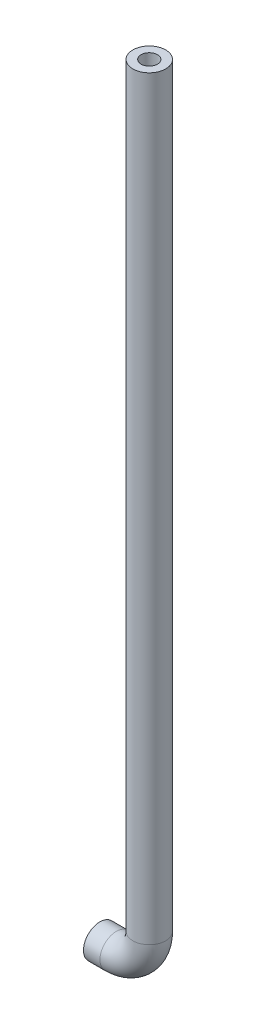
ISO-10303-21;
HEADER;
FILE_DESCRIPTION(('STEP AP214'),'2;1');
FILE_NAME('part.step','',(''),(''),'','','');
FILE_SCHEMA(('AUTOMOTIVE_DESIGN { 1 0 10303 214 1 1 1 1 }'));
ENDSEC;
DATA;
#1=APPLICATION_CONTEXT('core data for automotive mechanical design processes');
#2=APPLICATION_PROTOCOL_DEFINITION('international standard','automotive_design',2000,#1);
#3=PRODUCT_CONTEXT('',#1,'mechanical');
#4=PRODUCT('Part','Part','',(#3));
#5=PRODUCT_RELATED_PRODUCT_CATEGORY('part','',(#4));
#6=PRODUCT_DEFINITION_FORMATION('','',#4);
#7=PRODUCT_DEFINITION_CONTEXT('part definition',#1,'design');
#8=PRODUCT_DEFINITION('design','',#6,#7);
#9=PRODUCT_DEFINITION_SHAPE('','',#8);
#10=(LENGTH_UNIT() NAMED_UNIT(*) SI_UNIT(.MILLI.,.METRE.));
#11=(NAMED_UNIT(*) PLANE_ANGLE_UNIT() SI_UNIT($,.RADIAN.));
#12=(NAMED_UNIT(*) SI_UNIT($,.STERADIAN.) SOLID_ANGLE_UNIT());
#13=UNCERTAINTY_MEASURE_WITH_UNIT(LENGTH_MEASURE(1.E-05),#10,'distance_accuracy_value','');
#14=(GEOMETRIC_REPRESENTATION_CONTEXT(3) GLOBAL_UNCERTAINTY_ASSIGNED_CONTEXT((#13)) GLOBAL_UNIT_ASSIGNED_CONTEXT((#10,
#11,#12)) REPRESENTATION_CONTEXT('',''));
#15=CARTESIAN_POINT('',(0.,0.,0.));
#16=DIRECTION('',(0.,0.,1.));
#17=DIRECTION('',(1.,0.,0.));
#18=AXIS2_PLACEMENT_3D('',#15,#16,#17);
#19=CARTESIAN_POINT('',(38.0999999999999,608.33,0.));
#20=DIRECTION('',(0.,1.,0.));
#21=DIRECTION('',(-1.,0.,0.));
#22=AXIS2_PLACEMENT_3D('',#19,#20,#21);
#23=PLANE('',#22);
#24=CARTESIAN_POINT('',(38.0999999999999,608.33,0.));
#25=DIRECTION('',(0.,1.,0.));
#26=DIRECTION('',(-1.,0.,0.));
#27=AXIS2_PLACEMENT_3D('',#24,#25,#26);
#28=CIRCLE('',#27,6.35);
#29=CARTESIAN_POINT('',(31.7499999999999,608.33,0.));
#30=VERTEX_POINT('',#29);
#31=EDGE_CURVE('E106',#30,#30,#28,.T.);
#32=ORIENTED_EDGE('',*,*,#31,.F.);
#33=EDGE_LOOP('',(#32));
#34=FACE_BOUND('',#33,.T.);
#35=CARTESIAN_POINT('',(38.0999999999999,608.33,0.));
#36=DIRECTION('',(0.,1.,0.));
#37=DIRECTION('',(-1.,0.,0.));
#38=AXIS2_PLACEMENT_3D('',#35,#36,#37);
#39=CIRCLE('',#38,12.7);
#40=CARTESIAN_POINT('',(25.3999999999999,608.33,0.));
#41=VERTEX_POINT('',#40);
#42=EDGE_CURVE('E59',#41,#41,#39,.T.);
#43=ORIENTED_EDGE('',*,*,#42,.T.);
#44=EDGE_LOOP('',(#43));
#45=FACE_BOUND('',#44,.T.);
#46=ADVANCED_FACE('F47',(#34,#45),#23,.T.);
#47=CARTESIAN_POINT('',(0.,0.,0.));
#48=DIRECTION('',(1.,0.,0.));
#49=DIRECTION('',(0.,1.,0.));
#50=AXIS2_PLACEMENT_3D('',#47,#48,#49);
#51=PLANE('',#50);
#52=CARTESIAN_POINT('',(0.,0.,0.));
#53=DIRECTION('',(1.,0.,0.));
#54=DIRECTION('',(0.,1.,0.));
#55=AXIS2_PLACEMENT_3D('',#52,#53,#54);
#56=CIRCLE('',#55,6.35);
#57=CARTESIAN_POINT('',(0.,6.35,0.));
#58=VERTEX_POINT('',#57);
#59=EDGE_CURVE('E108',#58,#58,#56,.T.);
#60=ORIENTED_EDGE('',*,*,#59,.T.);
#61=EDGE_LOOP('',(#60));
#62=FACE_BOUND('',#61,.T.);
#63=CARTESIAN_POINT('',(0.,0.,0.));
#64=DIRECTION('',(1.,0.,0.));
#65=DIRECTION('',(0.,1.,0.));
#66=AXIS2_PLACEMENT_3D('',#63,#64,#65);
#67=CIRCLE('',#66,12.7);
#68=CARTESIAN_POINT('',(0.,12.7,0.));
#69=VERTEX_POINT('',#68);
#70=EDGE_CURVE('E12',#69,#69,#67,.T.);
#71=ORIENTED_EDGE('',*,*,#70,.F.);
#72=EDGE_LOOP('',(#71));
#73=FACE_BOUND('',#72,.T.);
#74=ADVANCED_FACE('F65',(#62,#73),#51,.F.);
#75=CARTESIAN_POINT('',(38.0999999999999,608.33,0.));
#76=DIRECTION('',(0.,-1.,0.));
#77=DIRECTION('',(1.,0.,0.));
#78=AXIS2_PLACEMENT_3D('',#75,#76,#77);
#79=CYLINDRICAL_SURFACE('',#78,12.7);
#80=CARTESIAN_POINT('',(38.1,25.4,0.));
#81=DIRECTION('',(0.,1.,0.));
#82=DIRECTION('',(-1.,0.,0.));
#83=AXIS2_PLACEMENT_3D('',#80,#81,#82);
#84=CIRCLE('',#83,12.7);
#85=CARTESIAN_POINT('',(50.8,25.4,0.));
#86=VERTEX_POINT('',#85);
#87=EDGE_CURVE('E115',#86,#86,#84,.T.);
#88=ORIENTED_EDGE('',*,*,#87,.T.);
#89=EDGE_LOOP('',(#88));
#90=FACE_BOUND('',#89,.T.);
#91=ORIENTED_EDGE('',*,*,#42,.F.);
#92=EDGE_LOOP('',(#91));
#93=FACE_BOUND('',#92,.T.);
#94=ADVANCED_FACE('F67',(#90,#93),#79,.T.);
#95=CARTESIAN_POINT('',(12.7,25.4,0.));
#96=DIRECTION('',(0.,0.,-1.));
#97=DIRECTION('',(-1.,0.,0.));
#98=AXIS2_PLACEMENT_3D('',#95,#96,#97);
#99=TOROIDAL_SURFACE('',#98,25.4,12.7);
#100=CARTESIAN_POINT('',(12.7,0.,0.));
#101=DIRECTION('',(1.,0.,0.));
#102=DIRECTION('',(0.,1.,0.));
#103=AXIS2_PLACEMENT_3D('',#100,#101,#102);
#104=CIRCLE('',#103,12.7);
#105=CARTESIAN_POINT('',(12.7,-12.7,0.));
#106=VERTEX_POINT('',#105);
#107=EDGE_CURVE('E54',#106,#106,#104,.T.);
#108=CARTESIAN_POINT('',(12.7,25.4,0.));
#109=DIRECTION('',(0.,0.,-1.));
#110=DIRECTION('',(-1.,0.,0.));
#111=AXIS2_PLACEMENT_3D('',#108,#109,#110);
#112=CIRCLE('',#111,38.1);
#113=EDGE_CURVE('',#86,#106,#112,.T.);
#114=ORIENTED_EDGE('',*,*,#87,.F.);
#115=ORIENTED_EDGE('',*,*,#107,.T.);
#116=ORIENTED_EDGE('',*,*,#113,.T.);
#117=ORIENTED_EDGE('',*,*,#113,.F.);
#118=EDGE_LOOP('',(#114,#116,#115,#117));
#119=FACE_BOUND('',#118,.T.);
#120=ADVANCED_FACE('F73',(#119),#99,.T.);
#121=CARTESIAN_POINT('',(12.7,0.,0.));
#122=DIRECTION('',(-1.,0.,0.));
#123=DIRECTION('',(0.,-1.,0.));
#124=AXIS2_PLACEMENT_3D('',#121,#122,#123);
#125=CYLINDRICAL_SURFACE('',#124,12.7);
#126=ORIENTED_EDGE('',*,*,#70,.T.);
#127=EDGE_LOOP('',(#126));
#128=FACE_BOUND('',#127,.T.);
#129=ORIENTED_EDGE('',*,*,#107,.F.);
#130=EDGE_LOOP('',(#129));
#131=FACE_BOUND('',#130,.T.);
#132=ADVANCED_FACE('F62',(#128,#131),#125,.T.);
#133=CARTESIAN_POINT('',(38.0999999999999,608.33,0.));
#134=DIRECTION('',(0.,-1.,0.));
#135=DIRECTION('',(1.,0.,0.));
#136=AXIS2_PLACEMENT_3D('',#133,#134,#135);
#137=CYLINDRICAL_SURFACE('',#136,6.35);
#138=CARTESIAN_POINT('',(38.1,25.4,0.));
#139=DIRECTION('',(0.,-1.,0.));
#140=DIRECTION('',(1.,0.,0.));
#141=AXIS2_PLACEMENT_3D('',#138,#139,#140);
#142=CIRCLE('',#141,6.35);
#143=CARTESIAN_POINT('',(44.45,25.4,0.));
#144=VERTEX_POINT('',#143);
#145=EDGE_CURVE('E105',#144,#144,#142,.F.);
#146=ORIENTED_EDGE('',*,*,#145,.F.);
#147=EDGE_LOOP('',(#146));
#148=FACE_BOUND('',#147,.T.);
#149=ORIENTED_EDGE('',*,*,#31,.T.);
#150=EDGE_LOOP('',(#149));
#151=FACE_BOUND('',#150,.T.);
#152=ADVANCED_FACE('F81',(#148,#151),#137,.F.);
#153=CARTESIAN_POINT('',(12.7,25.4,0.));
#154=DIRECTION('',(0.,0.,-1.));
#155=DIRECTION('',(-1.,0.,0.));
#156=AXIS2_PLACEMENT_3D('',#153,#154,#155);
#157=TOROIDAL_SURFACE('',#156,25.4,6.35);
#158=CARTESIAN_POINT('',(12.7,0.,0.));
#159=DIRECTION('',(1.,0.,0.));
#160=DIRECTION('',(0.,1.,0.));
#161=AXIS2_PLACEMENT_3D('',#158,#159,#160);
#162=CIRCLE('',#161,6.35);
#163=CARTESIAN_POINT('',(12.7,-6.35,0.));
#164=VERTEX_POINT('',#163);
#165=EDGE_CURVE('E102',#164,#164,#162,.T.);
#166=CARTESIAN_POINT('',(12.7,25.4,0.));
#167=DIRECTION('',(0.,0.,-1.));
#168=DIRECTION('',(-1.,0.,0.));
#169=AXIS2_PLACEMENT_3D('',#166,#167,#168);
#170=CIRCLE('',#169,31.75);
#171=EDGE_CURVE('',#144,#164,#170,.T.);
#172=ORIENTED_EDGE('',*,*,#145,.T.);
#173=ORIENTED_EDGE('',*,*,#165,.F.);
#174=ORIENTED_EDGE('',*,*,#171,.T.);
#175=ORIENTED_EDGE('',*,*,#171,.F.);
#176=EDGE_LOOP('',(#172,#174,#173,#175));
#177=FACE_BOUND('',#176,.T.);
#178=ADVANCED_FACE('F86',(#177),#157,.F.);
#179=CARTESIAN_POINT('',(12.7,0.,0.));
#180=DIRECTION('',(-1.,0.,0.));
#181=DIRECTION('',(0.,-1.,0.));
#182=AXIS2_PLACEMENT_3D('',#179,#180,#181);
#183=CYLINDRICAL_SURFACE('',#182,6.35);
#184=ORIENTED_EDGE('',*,*,#59,.F.);
#185=EDGE_LOOP('',(#184));
#186=FACE_BOUND('',#185,.T.);
#187=ORIENTED_EDGE('',*,*,#165,.T.);
#188=EDGE_LOOP('',(#187));
#189=FACE_BOUND('',#188,.T.);
#190=ADVANCED_FACE('F77',(#186,#189),#183,.F.);
#191=CLOSED_SHELL('',(#46,#74,#94,#120,#132,#152,#178,#190));
#192=MANIFOLD_SOLID_BREP('B2',#191);
#193=ADVANCED_BREP_SHAPE_REPRESENTATION('',(#18,#192),#14);
#194=SHAPE_DEFINITION_REPRESENTATION(#9,#193);
ENDSEC;
END-ISO-10303-21;
